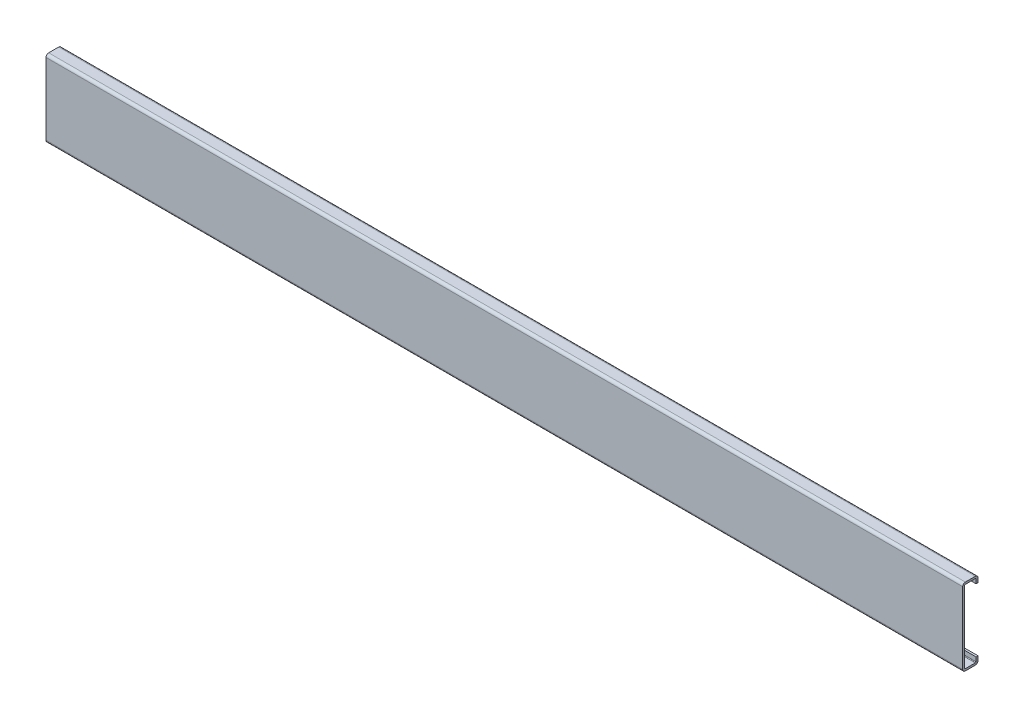
ISO-10303-21;
HEADER;
FILE_DESCRIPTION(('STEP AP214'),'2;1');
FILE_NAME('part.step','',(''),(''),'','','');
FILE_SCHEMA(('AUTOMOTIVE_DESIGN { 1 0 10303 214 1 1 1 1 }'));
ENDSEC;
DATA;
#1=APPLICATION_CONTEXT('core data for automotive mechanical design processes');
#2=APPLICATION_PROTOCOL_DEFINITION('international standard','automotive_design',2000,#1);
#3=PRODUCT_CONTEXT('',#1,'mechanical');
#4=PRODUCT('Part','Part','',(#3));
#5=PRODUCT_RELATED_PRODUCT_CATEGORY('part','',(#4));
#6=PRODUCT_DEFINITION_FORMATION('','',#4);
#7=PRODUCT_DEFINITION_CONTEXT('part definition',#1,'design');
#8=PRODUCT_DEFINITION('design','',#6,#7);
#9=PRODUCT_DEFINITION_SHAPE('','',#8);
#10=(LENGTH_UNIT() NAMED_UNIT(*) SI_UNIT(.MILLI.,.METRE.));
#11=(NAMED_UNIT(*) PLANE_ANGLE_UNIT() SI_UNIT($,.RADIAN.));
#12=(NAMED_UNIT(*) SI_UNIT($,.STERADIAN.) SOLID_ANGLE_UNIT());
#13=UNCERTAINTY_MEASURE_WITH_UNIT(LENGTH_MEASURE(1.E-05),#10,'distance_accuracy_value','');
#14=(GEOMETRIC_REPRESENTATION_CONTEXT(3) GLOBAL_UNCERTAINTY_ASSIGNED_CONTEXT((#13)) GLOBAL_UNIT_ASSIGNED_CONTEXT((#10,
#11,#12)) REPRESENTATION_CONTEXT('',''));
#15=CARTESIAN_POINT('',(0.,0.,0.));
#16=DIRECTION('',(0.,0.,1.));
#17=DIRECTION('',(1.,0.,0.));
#18=AXIS2_PLACEMENT_3D('',#15,#16,#17);
#19=CARTESIAN_POINT('',(550.,21.5,-7.4));
#20=DIRECTION('',(0.,0.,-1.));
#21=DIRECTION('',(-1.,0.,0.));
#22=AXIS2_PLACEMENT_3D('',#19,#20,#21);
#23=PLANE('',#22);
#24=DIRECTION('',(0.,1.,0.));
#25=VECTOR('',#24,1.);
#26=CARTESIAN_POINT('',(0.,21.5,-7.4));
#27=LINE('',#26,#25);
#28=CARTESIAN_POINT('',(0.,21.5,-7.4));
#29=VERTEX_POINT('',#28);
#30=CARTESIAN_POINT('',(0.,19.,-7.4));
#31=VERTEX_POINT('',#30);
#32=EDGE_CURVE('E202',#29,#31,#27,.F.);
#33=ORIENTED_EDGE('',*,*,#32,.T.);
#34=DIRECTION('',(-1.,0.,0.));
#35=VECTOR('',#34,1.);
#36=CARTESIAN_POINT('',(550.,19.,-7.4));
#37=LINE('',#36,#35);
#38=CARTESIAN_POINT('',(550.,19.,-7.4));
#39=VERTEX_POINT('',#38);
#40=EDGE_CURVE('E11',#39,#31,#37,.T.);
#41=ORIENTED_EDGE('',*,*,#40,.F.);
#42=DIRECTION('',(0.,1.,0.));
#43=VECTOR('',#42,1.);
#44=CARTESIAN_POINT('',(550.,21.5,-7.4));
#45=LINE('',#44,#43);
#46=CARTESIAN_POINT('',(550.,21.5,-7.4));
#47=VERTEX_POINT('',#46);
#48=EDGE_CURVE('E127',#47,#39,#45,.F.);
#49=ORIENTED_EDGE('',*,*,#48,.F.);
#50=DIRECTION('',(-1.,0.,0.));
#51=VECTOR('',#50,1.);
#52=CARTESIAN_POINT('',(550.,21.5,-7.4));
#53=LINE('',#52,#51);
#54=EDGE_CURVE('E198',#47,#29,#53,.T.);
#55=ORIENTED_EDGE('',*,*,#54,.T.);
#56=EDGE_LOOP('',(#33,#41,#49,#55));
#57=FACE_BOUND('',#56,.T.);
#58=ADVANCED_FACE('F35',(#57),#23,.F.);
#59=CARTESIAN_POINT('',(550.,19.,-8.6));
#60=DIRECTION('',(0.,-1.,0.));
#61=DIRECTION('',(0.,0.,-1.));
#62=AXIS2_PLACEMENT_3D('',#59,#60,#61);
#63=PLANE('',#62);
#64=DIRECTION('',(0.,0.,1.));
#65=VECTOR('',#64,1.);
#66=CARTESIAN_POINT('',(0.,19.,-8.6));
#67=LINE('',#66,#65);
#68=CARTESIAN_POINT('',(0.,19.,-8.6));
#69=VERTEX_POINT('',#68);
#70=EDGE_CURVE('E205',#69,#31,#67,.T.);
#71=ORIENTED_EDGE('',*,*,#70,.F.);
#72=DIRECTION('',(-1.,0.,0.));
#73=VECTOR('',#72,1.);
#74=CARTESIAN_POINT('',(550.,19.,-8.6));
#75=LINE('',#74,#73);
#76=CARTESIAN_POINT('',(550.,19.,-8.6));
#77=VERTEX_POINT('',#76);
#78=EDGE_CURVE('E43',#77,#69,#75,.T.);
#79=ORIENTED_EDGE('',*,*,#78,.F.);
#80=DIRECTION('',(0.,0.,1.));
#81=VECTOR('',#80,1.);
#82=CARTESIAN_POINT('',(550.,19.,-8.6));
#83=LINE('',#82,#81);
#84=EDGE_CURVE('E307',#77,#39,#83,.T.);
#85=ORIENTED_EDGE('',*,*,#84,.T.);
#86=ORIENTED_EDGE('',*,*,#40,.T.);
#87=EDGE_LOOP('',(#71,#79,#85,#86));
#88=FACE_BOUND('',#87,.T.);
#89=ADVANCED_FACE('F294',(#88),#63,.T.);
#90=CARTESIAN_POINT('',(550.,21.5,-8.6));
#91=DIRECTION('',(0.,0.,-1.));
#92=DIRECTION('',(-1.,0.,0.));
#93=AXIS2_PLACEMENT_3D('',#90,#91,#92);
#94=PLANE('',#93);
#95=DIRECTION('',(0.,1.,0.));
#96=VECTOR('',#95,1.);
#97=CARTESIAN_POINT('',(0.,21.5,-8.6));
#98=LINE('',#97,#96);
#99=CARTESIAN_POINT('',(0.,21.5,-8.6));
#100=VERTEX_POINT('',#99);
#101=EDGE_CURVE('E208',#100,#69,#98,.F.);
#102=ORIENTED_EDGE('',*,*,#101,.F.);
#103=DIRECTION('',(-1.,0.,0.));
#104=VECTOR('',#103,1.);
#105=CARTESIAN_POINT('',(550.,21.5,-8.6));
#106=LINE('',#105,#104);
#107=CARTESIAN_POINT('',(550.,21.5,-8.6));
#108=VERTEX_POINT('',#107);
#109=EDGE_CURVE('E284',#108,#100,#106,.T.);
#110=ORIENTED_EDGE('',*,*,#109,.F.);
#111=DIRECTION('',(0.,1.,0.));
#112=VECTOR('',#111,1.);
#113=CARTESIAN_POINT('',(550.,21.5,-8.6));
#114=LINE('',#113,#112);
#115=EDGE_CURVE('E291',#108,#77,#114,.F.);
#116=ORIENTED_EDGE('',*,*,#115,.T.);
#117=ORIENTED_EDGE('',*,*,#78,.T.);
#118=EDGE_LOOP('',(#102,#110,#116,#117));
#119=FACE_BOUND('',#118,.T.);
#120=ADVANCED_FACE('F289',(#119),#94,.T.);
#121=CARTESIAN_POINT('',(550.,21.5,-7.));
#122=DIRECTION('',(-1.,0.,0.));
#123=DIRECTION('',(0.,0.,1.));
#124=AXIS2_PLACEMENT_3D('',#121,#122,#123);
#125=CYLINDRICAL_SURFACE('',#124,1.6);
#126=CARTESIAN_POINT('',(0.,21.5,-7.));
#127=DIRECTION('',(1.,0.,0.));
#128=DIRECTION('',(0.,0.,-1.));
#129=AXIS2_PLACEMENT_3D('',#126,#127,#128);
#130=CIRCLE('',#129,1.6);
#131=CARTESIAN_POINT('',(0.,23.1,-7.));
#132=VERTEX_POINT('',#131);
#133=EDGE_CURVE('E211',#132,#100,#130,.F.);
#134=ORIENTED_EDGE('',*,*,#133,.F.);
#135=DIRECTION('',(-1.,0.,0.));
#136=VECTOR('',#135,1.);
#137=CARTESIAN_POINT('',(550.,23.1,-7.));
#138=LINE('',#137,#136);
#139=CARTESIAN_POINT('',(550.,23.1,-7.));
#140=VERTEX_POINT('',#139);
#141=EDGE_CURVE('E282',#140,#132,#138,.T.);
#142=ORIENTED_EDGE('',*,*,#141,.F.);
#143=CARTESIAN_POINT('',(550.,21.5,-7.));
#144=DIRECTION('',(1.,0.,0.));
#145=DIRECTION('',(0.,0.,-1.));
#146=AXIS2_PLACEMENT_3D('',#143,#144,#145);
#147=CIRCLE('',#146,1.6);
#148=EDGE_CURVE('E304',#140,#108,#147,.F.);
#149=ORIENTED_EDGE('',*,*,#148,.T.);
#150=ORIENTED_EDGE('',*,*,#109,.T.);
#151=EDGE_LOOP('',(#134,#142,#149,#150));
#152=FACE_BOUND('',#151,.T.);
#153=ADVANCED_FACE('F301',(#152),#125,.T.);
#154=CARTESIAN_POINT('',(550.,23.1,-1.));
#155=DIRECTION('',(0.,1.,0.));
#156=DIRECTION('',(0.,0.,1.));
#157=AXIS2_PLACEMENT_3D('',#154,#155,#156);
#158=PLANE('',#157);
#159=DIRECTION('',(0.,0.,-1.));
#160=VECTOR('',#159,1.);
#161=CARTESIAN_POINT('',(0.,23.1,-1.));
#162=LINE('',#161,#160);
#163=CARTESIAN_POINT('',(0.,23.1,-1.));
#164=VERTEX_POINT('',#163);
#165=EDGE_CURVE('E214',#164,#132,#162,.T.);
#166=ORIENTED_EDGE('',*,*,#165,.F.);
#167=DIRECTION('',(-1.,0.,0.));
#168=VECTOR('',#167,1.);
#169=CARTESIAN_POINT('',(550.,23.1,-1.));
#170=LINE('',#169,#168);
#171=CARTESIAN_POINT('',(550.,23.1,-1.));
#172=VERTEX_POINT('',#171);
#173=EDGE_CURVE('E280',#172,#164,#170,.T.);
#174=ORIENTED_EDGE('',*,*,#173,.F.);
#175=DIRECTION('',(0.,0.,-1.));
#176=VECTOR('',#175,1.);
#177=CARTESIAN_POINT('',(550.,23.1,-1.));
#178=LINE('',#177,#176);
#179=EDGE_CURVE('E309',#172,#140,#178,.T.);
#180=ORIENTED_EDGE('',*,*,#179,.T.);
#181=ORIENTED_EDGE('',*,*,#141,.T.);
#182=EDGE_LOOP('',(#166,#174,#180,#181));
#183=FACE_BOUND('',#182,.T.);
#184=ADVANCED_FACE('F375',(#183),#158,.T.);
#185=CARTESIAN_POINT('',(550.,21.5,-1.));
#186=DIRECTION('',(-1.,0.,0.));
#187=DIRECTION('',(0.,0.,1.));
#188=AXIS2_PLACEMENT_3D('',#185,#186,#187);
#189=CYLINDRICAL_SURFACE('',#188,1.6);
#190=CARTESIAN_POINT('',(0.,21.5,-1.));
#191=DIRECTION('',(1.,0.,0.));
#192=DIRECTION('',(0.,0.,-1.));
#193=AXIS2_PLACEMENT_3D('',#190,#191,#192);
#194=CIRCLE('',#193,1.6);
#195=CARTESIAN_POINT('',(0.,21.5,0.6));
#196=VERTEX_POINT('',#195);
#197=EDGE_CURVE('E217',#196,#164,#194,.F.);
#198=ORIENTED_EDGE('',*,*,#197,.F.);
#199=DIRECTION('',(-1.,0.,0.));
#200=VECTOR('',#199,1.);
#201=CARTESIAN_POINT('',(550.,21.5,0.6));
#202=LINE('',#201,#200);
#203=CARTESIAN_POINT('',(550.,21.5,0.6));
#204=VERTEX_POINT('',#203);
#205=EDGE_CURVE('E278',#204,#196,#202,.T.);
#206=ORIENTED_EDGE('',*,*,#205,.F.);
#207=CARTESIAN_POINT('',(550.,21.5,-1.));
#208=DIRECTION('',(1.,0.,0.));
#209=DIRECTION('',(0.,0.,-1.));
#210=AXIS2_PLACEMENT_3D('',#207,#208,#209);
#211=CIRCLE('',#210,1.6);
#212=EDGE_CURVE('E315',#204,#172,#211,.F.);
#213=ORIENTED_EDGE('',*,*,#212,.T.);
#214=ORIENTED_EDGE('',*,*,#173,.T.);
#215=EDGE_LOOP('',(#198,#206,#213,#214));
#216=FACE_BOUND('',#215,.T.);
#217=ADVANCED_FACE('F378',(#216),#189,.T.);
#218=CARTESIAN_POINT('',(550.,-21.5,0.6));
#219=DIRECTION('',(0.,0.,1.));
#220=DIRECTION('',(1.,0.,0.));
#221=AXIS2_PLACEMENT_3D('',#218,#219,#220);
#222=PLANE('',#221);
#223=DIRECTION('',(0.,1.,0.));
#224=VECTOR('',#223,1.);
#225=CARTESIAN_POINT('',(0.,-21.5,0.6));
#226=LINE('',#225,#224);
#227=CARTESIAN_POINT('',(0.,-21.5,0.6));
#228=VERTEX_POINT('',#227);
#229=EDGE_CURVE('E220',#228,#196,#226,.T.);
#230=ORIENTED_EDGE('',*,*,#229,.F.);
#231=DIRECTION('',(-1.,0.,0.));
#232=VECTOR('',#231,1.);
#233=CARTESIAN_POINT('',(550.,-21.5,0.6));
#234=LINE('',#233,#232);
#235=CARTESIAN_POINT('',(550.,-21.5,0.6));
#236=VERTEX_POINT('',#235);
#237=EDGE_CURVE('E276',#236,#228,#234,.T.);
#238=ORIENTED_EDGE('',*,*,#237,.F.);
#239=DIRECTION('',(0.,1.,0.));
#240=VECTOR('',#239,1.);
#241=CARTESIAN_POINT('',(550.,-21.5,0.6));
#242=LINE('',#241,#240);
#243=EDGE_CURVE('E318',#236,#204,#242,.T.);
#244=ORIENTED_EDGE('',*,*,#243,.T.);
#245=ORIENTED_EDGE('',*,*,#205,.T.);
#246=EDGE_LOOP('',(#230,#238,#244,#245));
#247=FACE_BOUND('',#246,.T.);
#248=ADVANCED_FACE('F382',(#247),#222,.T.);
#249=CARTESIAN_POINT('',(550.,-21.5,-1.));
#250=DIRECTION('',(-1.,0.,0.));
#251=DIRECTION('',(0.,0.,1.));
#252=AXIS2_PLACEMENT_3D('',#249,#250,#251);
#253=CYLINDRICAL_SURFACE('',#252,1.6);
#254=CARTESIAN_POINT('',(0.,-21.5,-1.));
#255=DIRECTION('',(1.,0.,0.));
#256=DIRECTION('',(0.,0.,-1.));
#257=AXIS2_PLACEMENT_3D('',#254,#255,#256);
#258=CIRCLE('',#257,1.6);
#259=CARTESIAN_POINT('',(0.,-23.1,-1.));
#260=VERTEX_POINT('',#259);
#261=EDGE_CURVE('E223',#260,#228,#258,.F.);
#262=ORIENTED_EDGE('',*,*,#261,.F.);
#263=DIRECTION('',(-1.,0.,0.));
#264=VECTOR('',#263,1.);
#265=CARTESIAN_POINT('',(550.,-23.1,-1.));
#266=LINE('',#265,#264);
#267=CARTESIAN_POINT('',(550.,-23.1,-1.));
#268=VERTEX_POINT('',#267);
#269=EDGE_CURVE('E274',#268,#260,#266,.T.);
#270=ORIENTED_EDGE('',*,*,#269,.F.);
#271=CARTESIAN_POINT('',(550.,-21.5,-1.));
#272=DIRECTION('',(1.,0.,0.));
#273=DIRECTION('',(0.,0.,-1.));
#274=AXIS2_PLACEMENT_3D('',#271,#272,#273);
#275=CIRCLE('',#274,1.6);
#276=EDGE_CURVE('E321',#268,#236,#275,.F.);
#277=ORIENTED_EDGE('',*,*,#276,.T.);
#278=ORIENTED_EDGE('',*,*,#237,.T.);
#279=EDGE_LOOP('',(#262,#270,#277,#278));
#280=FACE_BOUND('',#279,.T.);
#281=ADVANCED_FACE('F386',(#280),#253,.T.);
#282=CARTESIAN_POINT('',(550.,-23.1,-1.));
#283=DIRECTION('',(0.,-1.,0.));
#284=DIRECTION('',(0.,0.,-1.));
#285=AXIS2_PLACEMENT_3D('',#282,#283,#284);
#286=PLANE('',#285);
#287=DIRECTION('',(0.,0.,-1.));
#288=VECTOR('',#287,1.);
#289=CARTESIAN_POINT('',(0.,-23.1,-1.));
#290=LINE('',#289,#288);
#291=CARTESIAN_POINT('',(0.,-23.1,-7.));
#292=VERTEX_POINT('',#291);
#293=EDGE_CURVE('E226',#292,#260,#290,.F.);
#294=ORIENTED_EDGE('',*,*,#293,.F.);
#295=DIRECTION('',(-1.,0.,0.));
#296=VECTOR('',#295,1.);
#297=CARTESIAN_POINT('',(550.,-23.1,-7.));
#298=LINE('',#297,#296);
#299=CARTESIAN_POINT('',(550.,-23.1,-7.));
#300=VERTEX_POINT('',#299);
#301=EDGE_CURVE('E272',#300,#292,#298,.T.);
#302=ORIENTED_EDGE('',*,*,#301,.F.);
#303=DIRECTION('',(0.,0.,-1.));
#304=VECTOR('',#303,1.);
#305=CARTESIAN_POINT('',(550.,-23.1,-1.));
#306=LINE('',#305,#304);
#307=EDGE_CURVE('E324',#300,#268,#306,.F.);
#308=ORIENTED_EDGE('',*,*,#307,.T.);
#309=ORIENTED_EDGE('',*,*,#269,.T.);
#310=EDGE_LOOP('',(#294,#302,#308,#309));
#311=FACE_BOUND('',#310,.T.);
#312=ADVANCED_FACE('F390',(#311),#286,.T.);
#313=CARTESIAN_POINT('',(550.,-21.5,-7.));
#314=DIRECTION('',(-1.,0.,0.));
#315=DIRECTION('',(0.,0.,1.));
#316=AXIS2_PLACEMENT_3D('',#313,#314,#315);
#317=CYLINDRICAL_SURFACE('',#316,1.6);
#318=CARTESIAN_POINT('',(0.,-21.5,-7.));
#319=DIRECTION('',(1.,0.,0.));
#320=DIRECTION('',(0.,0.,-1.));
#321=AXIS2_PLACEMENT_3D('',#318,#319,#320);
#322=CIRCLE('',#321,1.6);
#323=CARTESIAN_POINT('',(0.,-21.5,-8.6));
#324=VERTEX_POINT('',#323);
#325=EDGE_CURVE('E229',#324,#292,#322,.F.);
#326=ORIENTED_EDGE('',*,*,#325,.F.);
#327=DIRECTION('',(-1.,0.,0.));
#328=VECTOR('',#327,1.);
#329=CARTESIAN_POINT('',(550.,-21.5,-8.6));
#330=LINE('',#329,#328);
#331=CARTESIAN_POINT('',(550.,-21.5,-8.6));
#332=VERTEX_POINT('',#331);
#333=EDGE_CURVE('E270',#332,#324,#330,.T.);
#334=ORIENTED_EDGE('',*,*,#333,.F.);
#335=CARTESIAN_POINT('',(550.,-21.5,-7.));
#336=DIRECTION('',(1.,0.,0.));
#337=DIRECTION('',(0.,0.,-1.));
#338=AXIS2_PLACEMENT_3D('',#335,#336,#337);
#339=CIRCLE('',#338,1.6);
#340=EDGE_CURVE('E327',#332,#300,#339,.F.);
#341=ORIENTED_EDGE('',*,*,#340,.T.);
#342=ORIENTED_EDGE('',*,*,#301,.T.);
#343=EDGE_LOOP('',(#326,#334,#341,#342));
#344=FACE_BOUND('',#343,.T.);
#345=ADVANCED_FACE('F394',(#344),#317,.T.);
#346=CARTESIAN_POINT('',(550.,-21.5,-8.6));
#347=DIRECTION('',(0.,0.,-1.));
#348=DIRECTION('',(-1.,0.,0.));
#349=AXIS2_PLACEMENT_3D('',#346,#347,#348);
#350=PLANE('',#349);
#351=DIRECTION('',(0.,1.,0.));
#352=VECTOR('',#351,1.);
#353=CARTESIAN_POINT('',(0.,-21.5,-8.6));
#354=LINE('',#353,#352);
#355=CARTESIAN_POINT('',(0.,-19.,-8.6));
#356=VERTEX_POINT('',#355);
#357=EDGE_CURVE('E232',#356,#324,#354,.F.);
#358=ORIENTED_EDGE('',*,*,#357,.F.);
#359=DIRECTION('',(-1.,0.,0.));
#360=VECTOR('',#359,1.);
#361=CARTESIAN_POINT('',(550.,-19.,-8.6));
#362=LINE('',#361,#360);
#363=CARTESIAN_POINT('',(550.,-19.,-8.6));
#364=VERTEX_POINT('',#363);
#365=EDGE_CURVE('E268',#364,#356,#362,.T.);
#366=ORIENTED_EDGE('',*,*,#365,.F.);
#367=DIRECTION('',(0.,1.,0.));
#368=VECTOR('',#367,1.);
#369=CARTESIAN_POINT('',(550.,-21.5,-8.6));
#370=LINE('',#369,#368);
#371=EDGE_CURVE('E330',#364,#332,#370,.F.);
#372=ORIENTED_EDGE('',*,*,#371,.T.);
#373=ORIENTED_EDGE('',*,*,#333,.T.);
#374=EDGE_LOOP('',(#358,#366,#372,#373));
#375=FACE_BOUND('',#374,.T.);
#376=ADVANCED_FACE('F398',(#375),#350,.T.);
#377=CARTESIAN_POINT('',(550.,-19.,-7.4));
#378=DIRECTION('',(0.,1.,0.));
#379=DIRECTION('',(0.,0.,1.));
#380=AXIS2_PLACEMENT_3D('',#377,#378,#379);
#381=PLANE('',#380);
#382=DIRECTION('',(0.,0.,-1.));
#383=VECTOR('',#382,1.);
#384=CARTESIAN_POINT('',(0.,-19.,-7.4));
#385=LINE('',#384,#383);
#386=CARTESIAN_POINT('',(0.,-19.,-7.4));
#387=VERTEX_POINT('',#386);
#388=EDGE_CURVE('E235',#387,#356,#385,.T.);
#389=ORIENTED_EDGE('',*,*,#388,.F.);
#390=DIRECTION('',(-1.,0.,0.));
#391=VECTOR('',#390,1.);
#392=CARTESIAN_POINT('',(550.,-19.,-7.4));
#393=LINE('',#392,#391);
#394=CARTESIAN_POINT('',(550.,-19.,-7.4));
#395=VERTEX_POINT('',#394);
#396=EDGE_CURVE('E266',#395,#387,#393,.T.);
#397=ORIENTED_EDGE('',*,*,#396,.F.);
#398=DIRECTION('',(0.,0.,-1.));
#399=VECTOR('',#398,1.);
#400=CARTESIAN_POINT('',(550.,-19.,-7.4));
#401=LINE('',#400,#399);
#402=EDGE_CURVE('E333',#395,#364,#401,.T.);
#403=ORIENTED_EDGE('',*,*,#402,.T.);
#404=ORIENTED_EDGE('',*,*,#365,.T.);
#405=EDGE_LOOP('',(#389,#397,#403,#404));
#406=FACE_BOUND('',#405,.T.);
#407=ADVANCED_FACE('F402',(#406),#381,.T.);
#408=CARTESIAN_POINT('',(550.,-21.5,-7.4));
#409=DIRECTION('',(0.,0.,-1.));
#410=DIRECTION('',(-1.,0.,0.));
#411=AXIS2_PLACEMENT_3D('',#408,#409,#410);
#412=PLANE('',#411);
#413=DIRECTION('',(0.,1.,0.));
#414=VECTOR('',#413,1.);
#415=CARTESIAN_POINT('',(0.,-21.5,-7.4));
#416=LINE('',#415,#414);
#417=CARTESIAN_POINT('',(0.,-21.5,-7.4));
#418=VERTEX_POINT('',#417);
#419=EDGE_CURVE('E238',#387,#418,#416,.F.);
#420=ORIENTED_EDGE('',*,*,#419,.T.);
#421=DIRECTION('',(-1.,0.,0.));
#422=VECTOR('',#421,1.);
#423=CARTESIAN_POINT('',(550.,-21.5,-7.4));
#424=LINE('',#423,#422);
#425=CARTESIAN_POINT('',(550.,-21.5,-7.4));
#426=VERTEX_POINT('',#425);
#427=EDGE_CURVE('E263',#426,#418,#424,.T.);
#428=ORIENTED_EDGE('',*,*,#427,.F.);
#429=DIRECTION('',(0.,1.,0.));
#430=VECTOR('',#429,1.);
#431=CARTESIAN_POINT('',(550.,-21.5,-7.4));
#432=LINE('',#431,#430);
#433=EDGE_CURVE('E336',#395,#426,#432,.F.);
#434=ORIENTED_EDGE('',*,*,#433,.F.);
#435=ORIENTED_EDGE('',*,*,#396,.T.);
#436=EDGE_LOOP('',(#420,#428,#434,#435));
#437=FACE_BOUND('',#436,.T.);
#438=ADVANCED_FACE('F406',(#437),#412,.F.);
#439=CARTESIAN_POINT('',(550.,-21.5,-7.));
#440=DIRECTION('',(-1.,0.,0.));
#441=DIRECTION('',(0.,0.,1.));
#442=AXIS2_PLACEMENT_3D('',#439,#440,#441);
#443=CYLINDRICAL_SURFACE('',#442,0.400000000000001);
#444=CARTESIAN_POINT('',(0.,-21.5,-7.));
#445=DIRECTION('',(1.,0.,0.));
#446=DIRECTION('',(0.,0.,-1.));
#447=AXIS2_PLACEMENT_3D('',#444,#445,#446);
#448=CIRCLE('',#447,0.400000000000001);
#449=CARTESIAN_POINT('',(0.,-21.9,-7.));
#450=VERTEX_POINT('',#449);
#451=EDGE_CURVE('E240',#418,#450,#448,.F.);
#452=ORIENTED_EDGE('',*,*,#451,.T.);
#453=DIRECTION('',(-1.,0.,0.));
#454=VECTOR('',#453,1.);
#455=CARTESIAN_POINT('',(550.,-21.9,-7.));
#456=LINE('',#455,#454);
#457=CARTESIAN_POINT('',(550.,-21.9,-7.));
#458=VERTEX_POINT('',#457);
#459=EDGE_CURVE('E260',#458,#450,#456,.T.);
#460=ORIENTED_EDGE('',*,*,#459,.F.);
#461=CARTESIAN_POINT('',(550.,-21.5,-7.));
#462=DIRECTION('',(1.,0.,0.));
#463=DIRECTION('',(0.,0.,-1.));
#464=AXIS2_PLACEMENT_3D('',#461,#462,#463);
#465=CIRCLE('',#464,0.400000000000001);
#466=EDGE_CURVE('E338',#426,#458,#465,.F.);
#467=ORIENTED_EDGE('',*,*,#466,.F.);
#468=ORIENTED_EDGE('',*,*,#427,.T.);
#469=EDGE_LOOP('',(#452,#460,#467,#468));
#470=FACE_BOUND('',#469,.T.);
#471=ADVANCED_FACE('F410',(#470),#443,.F.);
#472=CARTESIAN_POINT('',(550.,-21.9,-1.));
#473=DIRECTION('',(0.,-1.,0.));
#474=DIRECTION('',(0.,0.,-1.));
#475=AXIS2_PLACEMENT_3D('',#472,#473,#474);
#476=PLANE('',#475);
#477=DIRECTION('',(0.,0.,-1.));
#478=VECTOR('',#477,1.);
#479=CARTESIAN_POINT('',(0.,-21.9,-1.));
#480=LINE('',#479,#478);
#481=CARTESIAN_POINT('',(0.,-21.9,-1.));
#482=VERTEX_POINT('',#481);
#483=EDGE_CURVE('E242',#450,#482,#480,.F.);
#484=ORIENTED_EDGE('',*,*,#483,.T.);
#485=DIRECTION('',(-1.,0.,0.));
#486=VECTOR('',#485,1.);
#487=CARTESIAN_POINT('',(550.,-21.9,-1.));
#488=LINE('',#487,#486);
#489=CARTESIAN_POINT('',(550.,-21.9,-1.));
#490=VERTEX_POINT('',#489);
#491=EDGE_CURVE('E257',#490,#482,#488,.T.);
#492=ORIENTED_EDGE('',*,*,#491,.F.);
#493=DIRECTION('',(0.,0.,-1.));
#494=VECTOR('',#493,1.);
#495=CARTESIAN_POINT('',(550.,-21.9,-1.));
#496=LINE('',#495,#494);
#497=EDGE_CURVE('E340',#458,#490,#496,.F.);
#498=ORIENTED_EDGE('',*,*,#497,.F.);
#499=ORIENTED_EDGE('',*,*,#459,.T.);
#500=EDGE_LOOP('',(#484,#492,#498,#499));
#501=FACE_BOUND('',#500,.T.);
#502=ADVANCED_FACE('F414',(#501),#476,.F.);
#503=CARTESIAN_POINT('',(550.,-21.5,-1.));
#504=DIRECTION('',(-1.,0.,0.));
#505=DIRECTION('',(0.,0.,1.));
#506=AXIS2_PLACEMENT_3D('',#503,#504,#505);
#507=CYLINDRICAL_SURFACE('',#506,0.400000000000001);
#508=CARTESIAN_POINT('',(0.,-21.5,-1.));
#509=DIRECTION('',(1.,0.,0.));
#510=DIRECTION('',(0.,0.,-1.));
#511=AXIS2_PLACEMENT_3D('',#508,#509,#510);
#512=CIRCLE('',#511,0.400000000000001);
#513=CARTESIAN_POINT('',(0.,-21.5,-0.6));
#514=VERTEX_POINT('',#513);
#515=EDGE_CURVE('E244',#482,#514,#512,.F.);
#516=ORIENTED_EDGE('',*,*,#515,.T.);
#517=DIRECTION('',(-1.,0.,0.));
#518=VECTOR('',#517,1.);
#519=CARTESIAN_POINT('',(550.,-21.5,-0.6));
#520=LINE('',#519,#518);
#521=CARTESIAN_POINT('',(550.,-21.5,-0.6));
#522=VERTEX_POINT('',#521);
#523=EDGE_CURVE('E254',#522,#514,#520,.T.);
#524=ORIENTED_EDGE('',*,*,#523,.F.);
#525=CARTESIAN_POINT('',(550.,-21.5,-1.));
#526=DIRECTION('',(1.,0.,0.));
#527=DIRECTION('',(0.,0.,-1.));
#528=AXIS2_PLACEMENT_3D('',#525,#526,#527);
#529=CIRCLE('',#528,0.400000000000001);
#530=EDGE_CURVE('E342',#490,#522,#529,.F.);
#531=ORIENTED_EDGE('',*,*,#530,.F.);
#532=ORIENTED_EDGE('',*,*,#491,.T.);
#533=EDGE_LOOP('',(#516,#524,#531,#532));
#534=FACE_BOUND('',#533,.T.);
#535=ADVANCED_FACE('F348',(#534),#507,.F.);
#536=CARTESIAN_POINT('',(550.,-21.5,-0.6));
#537=DIRECTION('',(0.,0.,1.));
#538=DIRECTION('',(1.,0.,0.));
#539=AXIS2_PLACEMENT_3D('',#536,#537,#538);
#540=PLANE('',#539);
#541=DIRECTION('',(0.,1.,0.));
#542=VECTOR('',#541,1.);
#543=CARTESIAN_POINT('',(0.,-21.5,-0.6));
#544=LINE('',#543,#542);
#545=CARTESIAN_POINT('',(0.,21.5,-0.6));
#546=VERTEX_POINT('',#545);
#547=EDGE_CURVE('E246',#514,#546,#544,.T.);
#548=ORIENTED_EDGE('',*,*,#547,.T.);
#549=DIRECTION('',(-1.,0.,0.));
#550=VECTOR('',#549,1.);
#551=CARTESIAN_POINT('',(550.,21.5,-0.6));
#552=LINE('',#551,#550);
#553=CARTESIAN_POINT('',(550.,21.5,-0.6));
#554=VERTEX_POINT('',#553);
#555=EDGE_CURVE('E193',#554,#546,#552,.T.);
#556=ORIENTED_EDGE('',*,*,#555,.F.);
#557=DIRECTION('',(0.,1.,0.));
#558=VECTOR('',#557,1.);
#559=CARTESIAN_POINT('',(550.,-21.5,-0.6));
#560=LINE('',#559,#558);
#561=EDGE_CURVE('E184',#522,#554,#560,.T.);
#562=ORIENTED_EDGE('',*,*,#561,.F.);
#563=ORIENTED_EDGE('',*,*,#523,.T.);
#564=EDGE_LOOP('',(#548,#556,#562,#563));
#565=FACE_BOUND('',#564,.T.);
#566=ADVANCED_FACE('F352',(#565),#540,.F.);
#567=CARTESIAN_POINT('',(550.,21.5,-1.));
#568=DIRECTION('',(-1.,0.,0.));
#569=DIRECTION('',(0.,0.,1.));
#570=AXIS2_PLACEMENT_3D('',#567,#568,#569);
#571=CYLINDRICAL_SURFACE('',#570,0.400000000000001);
#572=CARTESIAN_POINT('',(0.,21.5,-1.));
#573=DIRECTION('',(1.,0.,0.));
#574=DIRECTION('',(0.,0.,-1.));
#575=AXIS2_PLACEMENT_3D('',#572,#573,#574);
#576=CIRCLE('',#575,0.400000000000001);
#577=CARTESIAN_POINT('',(0.,21.9,-1.));
#578=VERTEX_POINT('',#577);
#579=EDGE_CURVE('E192',#546,#578,#576,.F.);
#580=ORIENTED_EDGE('',*,*,#579,.T.);
#581=DIRECTION('',(-1.,0.,0.));
#582=VECTOR('',#581,1.);
#583=CARTESIAN_POINT('',(550.,21.9,-1.));
#584=LINE('',#583,#582);
#585=CARTESIAN_POINT('',(550.,21.9,-1.));
#586=VERTEX_POINT('',#585);
#587=EDGE_CURVE('E189',#586,#578,#584,.T.);
#588=ORIENTED_EDGE('',*,*,#587,.F.);
#589=CARTESIAN_POINT('',(550.,21.5,-1.));
#590=DIRECTION('',(1.,0.,0.));
#591=DIRECTION('',(0.,0.,-1.));
#592=AXIS2_PLACEMENT_3D('',#589,#590,#591);
#593=CIRCLE('',#592,0.400000000000001);
#594=EDGE_CURVE('E178',#554,#586,#593,.F.);
#595=ORIENTED_EDGE('',*,*,#594,.F.);
#596=ORIENTED_EDGE('',*,*,#555,.T.);
#597=EDGE_LOOP('',(#580,#588,#595,#596));
#598=FACE_BOUND('',#597,.T.);
#599=ADVANCED_FACE('F190',(#598),#571,.F.);
#600=CARTESIAN_POINT('',(550.,21.9,-1.));
#601=DIRECTION('',(0.,1.,0.));
#602=DIRECTION('',(0.,0.,1.));
#603=AXIS2_PLACEMENT_3D('',#600,#601,#602);
#604=PLANE('',#603);
#605=DIRECTION('',(0.,0.,-1.));
#606=VECTOR('',#605,1.);
#607=CARTESIAN_POINT('',(0.,21.9,-1.));
#608=LINE('',#607,#606);
#609=CARTESIAN_POINT('',(0.,21.9,-7.));
#610=VERTEX_POINT('',#609);
#611=EDGE_CURVE('E115',#578,#610,#608,.T.);
#612=ORIENTED_EDGE('',*,*,#611,.T.);
#613=DIRECTION('',(-1.,0.,0.));
#614=VECTOR('',#613,1.);
#615=CARTESIAN_POINT('',(550.,21.9,-7.));
#616=LINE('',#615,#614);
#617=CARTESIAN_POINT('',(550.,21.9,-7.));
#618=VERTEX_POINT('',#617);
#619=EDGE_CURVE('E194',#618,#610,#616,.T.);
#620=ORIENTED_EDGE('',*,*,#619,.F.);
#621=DIRECTION('',(0.,0.,-1.));
#622=VECTOR('',#621,1.);
#623=CARTESIAN_POINT('',(550.,21.9,-1.));
#624=LINE('',#623,#622);
#625=EDGE_CURVE('E182',#586,#618,#624,.T.);
#626=ORIENTED_EDGE('',*,*,#625,.F.);
#627=ORIENTED_EDGE('',*,*,#587,.T.);
#628=EDGE_LOOP('',(#612,#620,#626,#627));
#629=FACE_BOUND('',#628,.T.);
#630=ADVANCED_FACE('F196',(#629),#604,.F.);
#631=CARTESIAN_POINT('',(550.,21.5,-7.));
#632=DIRECTION('',(-1.,0.,0.));
#633=DIRECTION('',(0.,0.,1.));
#634=AXIS2_PLACEMENT_3D('',#631,#632,#633);
#635=CYLINDRICAL_SURFACE('',#634,0.400000000000001);
#636=CARTESIAN_POINT('',(0.,21.5,-7.));
#637=DIRECTION('',(1.,0.,0.));
#638=DIRECTION('',(0.,0.,-1.));
#639=AXIS2_PLACEMENT_3D('',#636,#637,#638);
#640=CIRCLE('',#639,0.400000000000001);
#641=EDGE_CURVE('E121',#610,#29,#640,.F.);
#642=ORIENTED_EDGE('',*,*,#641,.T.);
#643=ORIENTED_EDGE('',*,*,#54,.F.);
#644=CARTESIAN_POINT('',(550.,21.5,-7.));
#645=DIRECTION('',(1.,0.,0.));
#646=DIRECTION('',(0.,0.,-1.));
#647=AXIS2_PLACEMENT_3D('',#644,#645,#646);
#648=CIRCLE('',#647,0.400000000000001);
#649=EDGE_CURVE('E51',#618,#47,#648,.F.);
#650=ORIENTED_EDGE('',*,*,#649,.F.);
#651=ORIENTED_EDGE('',*,*,#619,.T.);
#652=EDGE_LOOP('',(#642,#643,#650,#651));
#653=FACE_BOUND('',#652,.T.);
#654=ADVANCED_FACE('F354',(#653),#635,.F.);
#655=CARTESIAN_POINT('',(550.,21.5,-7.));
#656=DIRECTION('',(1.,0.,0.));
#657=DIRECTION('',(0.,0.,-1.));
#658=AXIS2_PLACEMENT_3D('',#655,#656,#657);
#659=PLANE('',#658);
#660=ORIENTED_EDGE('',*,*,#48,.T.);
#661=ORIENTED_EDGE('',*,*,#84,.F.);
#662=ORIENTED_EDGE('',*,*,#115,.F.);
#663=ORIENTED_EDGE('',*,*,#148,.F.);
#664=ORIENTED_EDGE('',*,*,#179,.F.);
#665=ORIENTED_EDGE('',*,*,#212,.F.);
#666=ORIENTED_EDGE('',*,*,#243,.F.);
#667=ORIENTED_EDGE('',*,*,#276,.F.);
#668=ORIENTED_EDGE('',*,*,#307,.F.);
#669=ORIENTED_EDGE('',*,*,#340,.F.);
#670=ORIENTED_EDGE('',*,*,#371,.F.);
#671=ORIENTED_EDGE('',*,*,#402,.F.);
#672=ORIENTED_EDGE('',*,*,#433,.T.);
#673=ORIENTED_EDGE('',*,*,#466,.T.);
#674=ORIENTED_EDGE('',*,*,#497,.T.);
#675=ORIENTED_EDGE('',*,*,#530,.T.);
#676=ORIENTED_EDGE('',*,*,#561,.T.);
#677=ORIENTED_EDGE('',*,*,#594,.T.);
#678=ORIENTED_EDGE('',*,*,#625,.T.);
#679=ORIENTED_EDGE('',*,*,#649,.T.);
#680=EDGE_LOOP('',(#660,#661,#662,#663,#664,#665,#666,#667,#668,#669,#670,#671,#672,#673,#674,
#675,#676,#677,#678,#679));
#681=FACE_BOUND('',#680,.T.);
#682=ADVANCED_FACE('F180',(#681),#659,.T.);
#683=CARTESIAN_POINT('',(0.,21.5,-7.));
#684=DIRECTION('',(1.,0.,0.));
#685=DIRECTION('',(0.,0.,-1.));
#686=AXIS2_PLACEMENT_3D('',#683,#684,#685);
#687=PLANE('',#686);
#688=ORIENTED_EDGE('',*,*,#32,.F.);
#689=ORIENTED_EDGE('',*,*,#641,.F.);
#690=ORIENTED_EDGE('',*,*,#611,.F.);
#691=ORIENTED_EDGE('',*,*,#579,.F.);
#692=ORIENTED_EDGE('',*,*,#547,.F.);
#693=ORIENTED_EDGE('',*,*,#515,.F.);
#694=ORIENTED_EDGE('',*,*,#483,.F.);
#695=ORIENTED_EDGE('',*,*,#451,.F.);
#696=ORIENTED_EDGE('',*,*,#419,.F.);
#697=ORIENTED_EDGE('',*,*,#388,.T.);
#698=ORIENTED_EDGE('',*,*,#357,.T.);
#699=ORIENTED_EDGE('',*,*,#325,.T.);
#700=ORIENTED_EDGE('',*,*,#293,.T.);
#701=ORIENTED_EDGE('',*,*,#261,.T.);
#702=ORIENTED_EDGE('',*,*,#229,.T.);
#703=ORIENTED_EDGE('',*,*,#197,.T.);
#704=ORIENTED_EDGE('',*,*,#165,.T.);
#705=ORIENTED_EDGE('',*,*,#133,.T.);
#706=ORIENTED_EDGE('',*,*,#101,.T.);
#707=ORIENTED_EDGE('',*,*,#70,.T.);
#708=EDGE_LOOP('',(#688,#689,#690,#691,#692,#693,#694,#695,#696,#697,#698,#699,#700,#701,#702,
#703,#704,#705,#706,#707));
#709=FACE_BOUND('',#708,.T.);
#710=ADVANCED_FACE('F297',(#709),#687,.F.);
#711=CLOSED_SHELL('',(#58,#89,#120,#153,#184,#217,#248,#281,#312,#345,#376,#407,#438,#471,#502,
#535,#566,#599,#630,#654,#682,#710));
#712=MANIFOLD_SOLID_BREP('B2',#711);
#713=ADVANCED_BREP_SHAPE_REPRESENTATION('',(#18,#712),#14);
#714=SHAPE_DEFINITION_REPRESENTATION(#9,#713);
ENDSEC;
END-ISO-10303-21;
